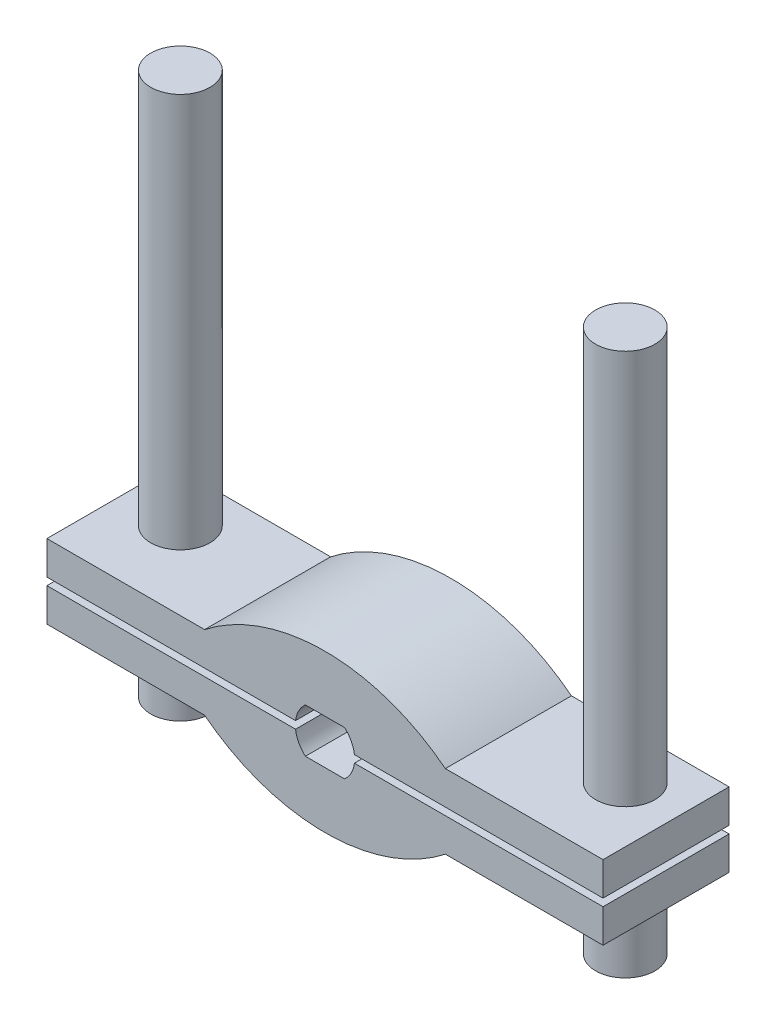
ISO-10303-21;
HEADER;
FILE_DESCRIPTION(('STEP AP214'),'2;1');
FILE_NAME('part.step','',(''),(''),'','','');
FILE_SCHEMA(('AUTOMOTIVE_DESIGN { 1 0 10303 214 1 1 1 1 }'));
ENDSEC;
DATA;
#1=APPLICATION_CONTEXT('core data for automotive mechanical design processes');
#2=APPLICATION_PROTOCOL_DEFINITION('international standard','automotive_design',2000,#1);
#3=PRODUCT_CONTEXT('',#1,'mechanical');
#4=PRODUCT('Part','Part','',(#3));
#5=PRODUCT_RELATED_PRODUCT_CATEGORY('part','',(#4));
#6=PRODUCT_DEFINITION_FORMATION('','',#4);
#7=PRODUCT_DEFINITION_CONTEXT('part definition',#1,'design');
#8=PRODUCT_DEFINITION('design','',#6,#7);
#9=PRODUCT_DEFINITION_SHAPE('','',#8);
#10=(LENGTH_UNIT() NAMED_UNIT(*) SI_UNIT(.MILLI.,.METRE.));
#11=(NAMED_UNIT(*) PLANE_ANGLE_UNIT() SI_UNIT($,.RADIAN.));
#12=(NAMED_UNIT(*) SI_UNIT($,.STERADIAN.) SOLID_ANGLE_UNIT());
#13=UNCERTAINTY_MEASURE_WITH_UNIT(LENGTH_MEASURE(1.E-05),#10,'distance_accuracy_value','');
#14=(GEOMETRIC_REPRESENTATION_CONTEXT(3) GLOBAL_UNCERTAINTY_ASSIGNED_CONTEXT((#13)) GLOBAL_UNIT_ASSIGNED_CONTEXT((#10,
#11,#12)) REPRESENTATION_CONTEXT('',''));
#15=CARTESIAN_POINT('',(0.,0.,0.));
#16=DIRECTION('',(0.,0.,1.));
#17=DIRECTION('',(1.,0.,0.));
#18=AXIS2_PLACEMENT_3D('',#15,#16,#17);
#19=CARTESIAN_POINT('',(0.,31.4655203588068,-111.672646407854));
#20=DIRECTION('',(0.,0.,1.));
#21=DIRECTION('',(1.,0.,0.));
#22=AXIS2_PLACEMENT_3D('',#19,#20,#21);
#23=CYLINDRICAL_SURFACE('',#22,52.6655203587927);
#24=CARTESIAN_POINT('',(0.,31.4655203588068,-33.9999999999999));
#25=DIRECTION('',(0.,0.,1.));
#26=DIRECTION('',(1.,0.,0.));
#27=AXIS2_PLACEMENT_3D('',#24,#25,#26);
#28=CIRCLE('',#27,52.6655203587927);
#29=CARTESIAN_POINT('',(32.4694880778216,-9.99999999999976,-33.9999999999999));
#30=VERTEX_POINT('',#29);
#31=CARTESIAN_POINT('',(-32.4694880778215,-9.99999999999999,-33.9999999999999));
#32=VERTEX_POINT('',#31);
#33=EDGE_CURVE('E57',#30,#32,#28,.F.);
#34=ORIENTED_EDGE('',*,*,#33,.F.);
#35=DIRECTION('',(0.,0.,1.));
#36=VECTOR('',#35,1.);
#37=CARTESIAN_POINT('',(32.4694880778216,-9.99999999999976,-111.672646407854));
#38=LINE('',#37,#36);
#39=CARTESIAN_POINT('',(32.4694880778216,-9.99999999999976,0.));
#40=VERTEX_POINT('',#39);
#41=EDGE_CURVE('E212',#30,#40,#38,.T.);
#42=ORIENTED_EDGE('',*,*,#41,.T.);
#43=CARTESIAN_POINT('',(0.,31.4655203588068,0.));
#44=DIRECTION('',(0.,0.,1.));
#45=DIRECTION('',(-1.,0.,0.));
#46=AXIS2_PLACEMENT_3D('',#43,#44,#45);
#47=CIRCLE('',#46,52.6655203587927);
#48=CARTESIAN_POINT('',(-32.4694880778215,-9.99999999999999,0.));
#49=VERTEX_POINT('',#48);
#50=EDGE_CURVE('E183',#49,#40,#47,.T.);
#51=ORIENTED_EDGE('',*,*,#50,.F.);
#52=DIRECTION('',(0.,0.,1.));
#53=VECTOR('',#52,1.);
#54=CARTESIAN_POINT('',(-32.4694880778215,-9.99999999999999,-111.672646407854));
#55=LINE('',#54,#53);
#56=EDGE_CURVE('E167',#32,#49,#55,.T.);
#57=ORIENTED_EDGE('',*,*,#56,.F.);
#58=EDGE_LOOP('',(#34,#42,#51,#57));
#59=FACE_BOUND('',#58,.T.);
#60=ADVANCED_FACE('F49',(#59),#23,.T.);
#61=CARTESIAN_POINT('',(-32.4694880778215,-9.99999999999999,-111.672646407854));
#62=DIRECTION('',(0.,-1.,0.));
#63=DIRECTION('',(1.,0.,0.));
#64=AXIS2_PLACEMENT_3D('',#61,#62,#63);
#65=PLANE('',#64);
#66=CARTESIAN_POINT('',(-60.,-9.99999999999999,-21.));
#67=DIRECTION('',(0.,-1.,0.));
#68=DIRECTION('',(1.,0.,0.));
#69=AXIS2_PLACEMENT_3D('',#66,#67,#68);
#70=CIRCLE('',#69,8.25);
#71=CARTESIAN_POINT('',(-51.75,-9.99999999999999,-21.));
#72=VERTEX_POINT('',#71);
#73=EDGE_CURVE('E159',#72,#72,#70,.T.);
#74=ORIENTED_EDGE('',*,*,#73,.F.);
#75=EDGE_LOOP('',(#74));
#76=FACE_BOUND('',#75,.T.);
#77=DIRECTION('',(-1.,0.,0.));
#78=VECTOR('',#77,1.);
#79=CARTESIAN_POINT('',(-32.4694880778215,-9.99999999999999,-33.9999999999999));
#80=LINE('',#79,#78);
#81=CARTESIAN_POINT('',(-75.,-9.99999999999999,-33.9999999999999));
#82=VERTEX_POINT('',#81);
#83=EDGE_CURVE('E170',#32,#82,#80,.T.);
#84=ORIENTED_EDGE('',*,*,#83,.F.);
#85=ORIENTED_EDGE('',*,*,#56,.T.);
#86=DIRECTION('',(1.,0.,0.));
#87=VECTOR('',#86,1.);
#88=CARTESIAN_POINT('',(-32.4694880778215,-9.99999999999999,0.));
#89=LINE('',#88,#87);
#90=CARTESIAN_POINT('',(-75.,-9.99999999999999,0.));
#91=VERTEX_POINT('',#90);
#92=EDGE_CURVE('E180',#91,#49,#89,.T.);
#93=ORIENTED_EDGE('',*,*,#92,.F.);
#94=DIRECTION('',(0.,0.,1.));
#95=VECTOR('',#94,1.);
#96=CARTESIAN_POINT('',(-75.,-9.99999999999999,-111.672646407854));
#97=LINE('',#96,#95);
#98=EDGE_CURVE('E186',#82,#91,#97,.T.);
#99=ORIENTED_EDGE('',*,*,#98,.F.);
#100=EDGE_LOOP('',(#84,#85,#93,#99));
#101=FACE_BOUND('',#100,.T.);
#102=ADVANCED_FACE('F206',(#76,#101),#65,.T.);
#103=CARTESIAN_POINT('',(-75.,-0.99999999999999,-111.672646407854));
#104=DIRECTION('',(-1.,0.,0.));
#105=DIRECTION('',(0.,0.,1.));
#106=AXIS2_PLACEMENT_3D('',#103,#104,#105);
#107=PLANE('',#106);
#108=DIRECTION('',(0.,1.,0.));
#109=VECTOR('',#108,1.);
#110=CARTESIAN_POINT('',(-75.,-0.99999999999999,-33.9999999999999));
#111=LINE('',#110,#109);
#112=CARTESIAN_POINT('',(-75.,-0.99999999999999,-33.9999999999999));
#113=VERTEX_POINT('',#112);
#114=EDGE_CURVE('E69',#82,#113,#111,.T.);
#115=ORIENTED_EDGE('',*,*,#114,.F.);
#116=ORIENTED_EDGE('',*,*,#98,.T.);
#117=DIRECTION('',(0.,-1.,0.));
#118=VECTOR('',#117,1.);
#119=CARTESIAN_POINT('',(-75.,-0.99999999999999,0.));
#120=LINE('',#119,#118);
#121=CARTESIAN_POINT('',(-75.,-0.99999999999999,0.));
#122=VERTEX_POINT('',#121);
#123=EDGE_CURVE('E177',#122,#91,#120,.T.);
#124=ORIENTED_EDGE('',*,*,#123,.F.);
#125=DIRECTION('',(0.,0.,1.));
#126=VECTOR('',#125,1.);
#127=CARTESIAN_POINT('',(-75.,-0.99999999999999,-111.672646407854));
#128=LINE('',#127,#126);
#129=EDGE_CURVE('E188',#113,#122,#128,.T.);
#130=ORIENTED_EDGE('',*,*,#129,.F.);
#131=EDGE_LOOP('',(#115,#116,#124,#130));
#132=FACE_BOUND('',#131,.T.);
#133=ADVANCED_FACE('F202',(#132),#107,.T.);
#134=CARTESIAN_POINT('',(-7.9372539331829,-0.999999999999999,-111.672646407854));
#135=DIRECTION('',(0.,1.,0.));
#136=DIRECTION('',(-1.,0.,0.));
#137=AXIS2_PLACEMENT_3D('',#134,#135,#136);
#138=PLANE('',#137);
#139=CARTESIAN_POINT('',(-60.,-0.99999999999999,-21.));
#140=DIRECTION('',(0.,1.,0.));
#141=DIRECTION('',(-1.,0.,0.));
#142=AXIS2_PLACEMENT_3D('',#139,#140,#141);
#143=CIRCLE('',#142,8.25);
#144=CARTESIAN_POINT('',(-68.25,-0.999999999999989,-21.));
#145=VERTEX_POINT('',#144);
#146=EDGE_CURVE('E135',#145,#145,#143,.F.);
#147=ORIENTED_EDGE('',*,*,#146,.T.);
#148=EDGE_LOOP('',(#147));
#149=FACE_BOUND('',#148,.T.);
#150=DIRECTION('',(1.,0.,0.));
#151=VECTOR('',#150,1.);
#152=CARTESIAN_POINT('',(-7.9372539331829,-0.999999999999999,-33.9999999999999));
#153=LINE('',#152,#151);
#154=CARTESIAN_POINT('',(-7.9372539331829,-0.999999999999999,-33.9999999999999));
#155=VERTEX_POINT('',#154);
#156=EDGE_CURVE('E64',#113,#155,#153,.T.);
#157=ORIENTED_EDGE('',*,*,#156,.F.);
#158=ORIENTED_EDGE('',*,*,#129,.T.);
#159=DIRECTION('',(-1.,0.,0.));
#160=VECTOR('',#159,1.);
#161=CARTESIAN_POINT('',(-7.9372539331829,-0.999999999999999,0.));
#162=LINE('',#161,#160);
#163=CARTESIAN_POINT('',(-7.9372539331829,-0.999999999999999,0.));
#164=VERTEX_POINT('',#163);
#165=EDGE_CURVE('E174',#164,#122,#162,.T.);
#166=ORIENTED_EDGE('',*,*,#165,.F.);
#167=DIRECTION('',(0.,0.,1.));
#168=VECTOR('',#167,1.);
#169=CARTESIAN_POINT('',(-7.9372539331829,-0.999999999999999,-111.672646407854));
#170=LINE('',#169,#168);
#171=EDGE_CURVE('E190',#155,#164,#170,.T.);
#172=ORIENTED_EDGE('',*,*,#171,.F.);
#173=EDGE_LOOP('',(#157,#158,#166,#172));
#174=FACE_BOUND('',#173,.T.);
#175=ADVANCED_FACE('F196',(#149,#174),#138,.T.);
#176=CARTESIAN_POINT('',(0.,0.,-111.672646407854));
#177=DIRECTION('',(0.,0.,1.));
#178=DIRECTION('',(1.,0.,0.));
#179=AXIS2_PLACEMENT_3D('',#176,#177,#178);
#180=CYLINDRICAL_SURFACE('',#179,7.99999999998921);
#181=CARTESIAN_POINT('',(0.,0.,-33.9999999999999));
#182=DIRECTION('',(0.,0.,1.));
#183=DIRECTION('',(1.,0.,0.));
#184=AXIS2_PLACEMENT_3D('',#181,#182,#183);
#185=CIRCLE('',#184,7.99999999998921);
#186=CARTESIAN_POINT('',(-5.29150262213566,-5.9999999999799,-33.9999999999999));
#187=VERTEX_POINT('',#186);
#188=EDGE_CURVE('E165',#155,#187,#185,.T.);
#189=ORIENTED_EDGE('',*,*,#188,.F.);
#190=ORIENTED_EDGE('',*,*,#171,.T.);
#191=CARTESIAN_POINT('',(0.,0.,0.));
#192=DIRECTION('',(0.,0.,-1.));
#193=DIRECTION('',(-1.,0.,0.));
#194=AXIS2_PLACEMENT_3D('',#191,#192,#193);
#195=CIRCLE('',#194,7.99999999998921);
#196=CARTESIAN_POINT('',(-5.29150262213566,-5.9999999999799,0.));
#197=VERTEX_POINT('',#196);
#198=EDGE_CURVE('E134',#197,#164,#195,.T.);
#199=ORIENTED_EDGE('',*,*,#198,.F.);
#200=DIRECTION('',(0.,0.,1.));
#201=VECTOR('',#200,1.);
#202=CARTESIAN_POINT('',(-5.29150262213566,-5.9999999999799,-111.672646407854));
#203=LINE('',#202,#201);
#204=EDGE_CURVE('E130',#187,#197,#203,.T.);
#205=ORIENTED_EDGE('',*,*,#204,.F.);
#206=EDGE_LOOP('',(#189,#190,#199,#205));
#207=FACE_BOUND('',#206,.T.);
#208=ADVANCED_FACE('F194',(#207),#180,.F.);
#209=CARTESIAN_POINT('',(0.,-5.99999999997181,-111.672646407854));
#210=DIRECTION('',(-1.52917200113342E-12,1.,0.));
#211=DIRECTION('',(-1.,-1.52917200113342E-12,0.));
#212=AXIS2_PLACEMENT_3D('',#209,#210,#211);
#213=PLANE('',#212);
#214=DIRECTION('',(1.,1.52917200113342E-12,0.));
#215=VECTOR('',#214,1.);
#216=CARTESIAN_POINT('',(0.,-5.99999999997181,-33.9999999999999));
#217=LINE('',#216,#215);
#218=CARTESIAN_POINT('',(5.2915026221357,-5.99999999997986,-33.9999999999999));
#219=VERTEX_POINT('',#218);
#220=EDGE_CURVE('E12',#187,#219,#217,.T.);
#221=ORIENTED_EDGE('',*,*,#220,.F.);
#222=ORIENTED_EDGE('',*,*,#204,.T.);
#223=DIRECTION('',(-1.,-1.52917200113342E-12,0.));
#224=VECTOR('',#223,1.);
#225=CARTESIAN_POINT('',(0.,-5.99999999997181,0.));
#226=LINE('',#225,#224);
#227=CARTESIAN_POINT('',(5.2915026221357,-5.99999999997986,0.));
#228=VERTEX_POINT('',#227);
#229=EDGE_CURVE('E123',#228,#197,#226,.T.);
#230=ORIENTED_EDGE('',*,*,#229,.F.);
#231=DIRECTION('',(0.,0.,1.));
#232=VECTOR('',#231,1.);
#233=CARTESIAN_POINT('',(5.2915026221357,-5.99999999997986,-111.672646407854));
#234=LINE('',#233,#232);
#235=EDGE_CURVE('E127',#219,#228,#234,.T.);
#236=ORIENTED_EDGE('',*,*,#235,.F.);
#237=EDGE_LOOP('',(#221,#222,#230,#236));
#238=FACE_BOUND('',#237,.T.);
#239=ADVANCED_FACE('F51',(#238),#213,.T.);
#240=CARTESIAN_POINT('',(0.,0.,0.));
#241=DIRECTION('',(0.,0.,-1.));
#242=DIRECTION('',(-1.,0.,0.));
#243=AXIS2_PLACEMENT_3D('',#240,#241,#242);
#244=PLANE('',#243);
#245=ORIENTED_EDGE('',*,*,#50,.T.);
#246=DIRECTION('',(-1.,0.,0.));
#247=VECTOR('',#246,1.);
#248=CARTESIAN_POINT('',(32.4694880778216,-9.99999999999976,0.));
#249=LINE('',#248,#247);
#250=CARTESIAN_POINT('',(75.0000000000001,-9.99999999999944,0.));
#251=VERTEX_POINT('',#250);
#252=EDGE_CURVE('E150',#251,#40,#249,.T.);
#253=ORIENTED_EDGE('',*,*,#252,.F.);
#254=DIRECTION('',(0.,-1.,0.));
#255=VECTOR('',#254,1.);
#256=CARTESIAN_POINT('',(75.,-0.999999999999444,0.));
#257=LINE('',#256,#255);
#258=CARTESIAN_POINT('',(75.,-0.999999999999444,0.));
#259=VERTEX_POINT('',#258);
#260=EDGE_CURVE('E155',#259,#251,#257,.T.);
#261=ORIENTED_EDGE('',*,*,#260,.F.);
#262=DIRECTION('',(1.,0.,0.));
#263=VECTOR('',#262,1.);
#264=CARTESIAN_POINT('',(7.9372539331829,-0.999999999999942,0.));
#265=LINE('',#264,#263);
#266=CARTESIAN_POINT('',(7.9372539331829,-0.999999999999942,0.));
#267=VERTEX_POINT('',#266);
#268=EDGE_CURVE('E141',#267,#259,#265,.T.);
#269=ORIENTED_EDGE('',*,*,#268,.F.);
#270=CARTESIAN_POINT('',(0.,0.,0.));
#271=DIRECTION('',(0.,0.,1.));
#272=DIRECTION('',(1.,0.,0.));
#273=AXIS2_PLACEMENT_3D('',#270,#271,#272);
#274=CIRCLE('',#273,7.99999999998921);
#275=EDGE_CURVE('E138',#228,#267,#274,.T.);
#276=ORIENTED_EDGE('',*,*,#275,.F.);
#277=ORIENTED_EDGE('',*,*,#229,.T.);
#278=ORIENTED_EDGE('',*,*,#198,.T.);
#279=ORIENTED_EDGE('',*,*,#165,.T.);
#280=ORIENTED_EDGE('',*,*,#123,.T.);
#281=ORIENTED_EDGE('',*,*,#92,.T.);
#282=EDGE_LOOP('',(#245,#253,#261,#269,#276,#277,#278,#279,#280,#281));
#283=FACE_BOUND('',#282,.T.);
#284=ADVANCED_FACE('F139',(#283),#244,.F.);
#285=CARTESIAN_POINT('',(-7.99999999999956,0.,-33.9999999999999));
#286=DIRECTION('',(0.,0.,1.));
#287=DIRECTION('',(0.,1.,0.));
#288=AXIS2_PLACEMENT_3D('',#285,#286,#287);
#289=PLANE('',#288);
#290=ORIENTED_EDGE('',*,*,#220,.T.);
#291=CARTESIAN_POINT('',(0.,0.,-33.9999999999999));
#292=DIRECTION('',(0.,0.,-1.));
#293=DIRECTION('',(-1.,0.,0.));
#294=AXIS2_PLACEMENT_3D('',#291,#292,#293);
#295=CIRCLE('',#294,7.99999999998921);
#296=CARTESIAN_POINT('',(7.9372539331829,-0.999999999999942,-33.9999999999999));
#297=VERTEX_POINT('',#296);
#298=EDGE_CURVE('E148',#297,#219,#295,.T.);
#299=ORIENTED_EDGE('',*,*,#298,.F.);
#300=DIRECTION('',(-1.,0.,0.));
#301=VECTOR('',#300,1.);
#302=CARTESIAN_POINT('',(7.9372539331829,-0.999999999999942,-33.9999999999999));
#303=LINE('',#302,#301);
#304=CARTESIAN_POINT('',(75.,-0.999999999999444,-33.9999999999999));
#305=VERTEX_POINT('',#304);
#306=EDGE_CURVE('E231',#305,#297,#303,.T.);
#307=ORIENTED_EDGE('',*,*,#306,.F.);
#308=DIRECTION('',(0.,1.,0.));
#309=VECTOR('',#308,1.);
#310=CARTESIAN_POINT('',(75.,-0.999999999999444,-33.9999999999999));
#311=LINE('',#310,#309);
#312=CARTESIAN_POINT('',(75.0000000000001,-9.99999999999944,-33.9999999999999));
#313=VERTEX_POINT('',#312);
#314=EDGE_CURVE('E229',#313,#305,#311,.T.);
#315=ORIENTED_EDGE('',*,*,#314,.F.);
#316=DIRECTION('',(1.,0.,0.));
#317=VECTOR('',#316,1.);
#318=CARTESIAN_POINT('',(32.4694880778216,-9.99999999999976,-33.9999999999999));
#319=LINE('',#318,#317);
#320=EDGE_CURVE('E162',#30,#313,#319,.T.);
#321=ORIENTED_EDGE('',*,*,#320,.F.);
#322=ORIENTED_EDGE('',*,*,#33,.T.);
#323=ORIENTED_EDGE('',*,*,#83,.T.);
#324=ORIENTED_EDGE('',*,*,#114,.T.);
#325=ORIENTED_EDGE('',*,*,#156,.T.);
#326=ORIENTED_EDGE('',*,*,#188,.T.);
#327=EDGE_LOOP('',(#290,#299,#307,#315,#321,#322,#323,#324,#325,#326));
#328=FACE_BOUND('',#327,.T.);
#329=ADVANCED_FACE('F254',(#328),#289,.F.);
#330=CARTESIAN_POINT('',(-60.,22.3345237791561,-21.));
#331=DIRECTION('',(0.,-1.,0.));
#332=DIRECTION('',(1.,0.,0.));
#333=AXIS2_PLACEMENT_3D('',#330,#331,#332);
#334=CYLINDRICAL_SURFACE('',#333,8.25);
#335=ORIENTED_EDGE('',*,*,#73,.T.);
#336=EDGE_LOOP('',(#335));
#337=FACE_BOUND('',#336,.T.);
#338=ORIENTED_EDGE('',*,*,#146,.F.);
#339=EDGE_LOOP('',(#338));
#340=FACE_BOUND('',#339,.T.);
#341=ADVANCED_FACE('F260',(#337,#340),#334,.F.);
#342=CARTESIAN_POINT('',(32.4694880778216,-9.99999999999976,-111.672646407854));
#343=DIRECTION('',(0.,-1.,0.));
#344=DIRECTION('',(-1.,0.,0.));
#345=AXIS2_PLACEMENT_3D('',#342,#343,#344);
#346=PLANE('',#345);
#347=CARTESIAN_POINT('',(60.0000000000001,-9.99999999999955,-21.));
#348=DIRECTION('',(0.,1.,0.));
#349=DIRECTION('',(-1.,0.,0.));
#350=AXIS2_PLACEMENT_3D('',#347,#348,#349);
#351=CIRCLE('',#350,8.25);
#352=CARTESIAN_POINT('',(51.75,-9.99999999999961,-21.));
#353=VERTEX_POINT('',#352);
#354=EDGE_CURVE('E237',#353,#353,#351,.T.);
#355=ORIENTED_EDGE('',*,*,#354,.T.);
#356=EDGE_LOOP('',(#355));
#357=FACE_BOUND('',#356,.T.);
#358=ORIENTED_EDGE('',*,*,#320,.T.);
#359=DIRECTION('',(0.,0.,1.));
#360=VECTOR('',#359,1.);
#361=CARTESIAN_POINT('',(75.0000000000001,-9.99999999999944,-111.672646407854));
#362=LINE('',#361,#360);
#363=EDGE_CURVE('E219',#313,#251,#362,.T.);
#364=ORIENTED_EDGE('',*,*,#363,.T.);
#365=ORIENTED_EDGE('',*,*,#252,.T.);
#366=ORIENTED_EDGE('',*,*,#41,.F.);
#367=EDGE_LOOP('',(#358,#364,#365,#366));
#368=FACE_BOUND('',#367,.T.);
#369=ADVANCED_FACE('F217',(#357,#368),#346,.T.);
#370=CARTESIAN_POINT('',(75.,-0.999999999999444,-111.672646407854));
#371=DIRECTION('',(1.,0.,0.));
#372=DIRECTION('',(0.,0.,1.));
#373=AXIS2_PLACEMENT_3D('',#370,#371,#372);
#374=PLANE('',#373);
#375=ORIENTED_EDGE('',*,*,#314,.T.);
#376=DIRECTION('',(0.,0.,1.));
#377=VECTOR('',#376,1.);
#378=CARTESIAN_POINT('',(75.,-0.999999999999444,-111.672646407854));
#379=LINE('',#378,#377);
#380=EDGE_CURVE('E152',#305,#259,#379,.T.);
#381=ORIENTED_EDGE('',*,*,#380,.T.);
#382=ORIENTED_EDGE('',*,*,#260,.T.);
#383=ORIENTED_EDGE('',*,*,#363,.F.);
#384=EDGE_LOOP('',(#375,#381,#382,#383));
#385=FACE_BOUND('',#384,.T.);
#386=ADVANCED_FACE('F251',(#385),#374,.T.);
#387=CARTESIAN_POINT('',(7.9372539331829,-0.999999999999942,-111.672646407854));
#388=DIRECTION('',(0.,1.,0.));
#389=DIRECTION('',(1.,0.,0.));
#390=AXIS2_PLACEMENT_3D('',#387,#388,#389);
#391=PLANE('',#390);
#392=CARTESIAN_POINT('',(60.,-0.999999999999552,-21.));
#393=DIRECTION('',(0.,-1.,0.));
#394=DIRECTION('',(1.,0.,0.));
#395=AXIS2_PLACEMENT_3D('',#392,#393,#394);
#396=CIRCLE('',#395,8.25);
#397=CARTESIAN_POINT('',(68.25,-0.99999999999949,-21.));
#398=VERTEX_POINT('',#397);
#399=EDGE_CURVE('E145',#398,#398,#396,.F.);
#400=ORIENTED_EDGE('',*,*,#399,.F.);
#401=EDGE_LOOP('',(#400));
#402=FACE_BOUND('',#401,.T.);
#403=ORIENTED_EDGE('',*,*,#306,.T.);
#404=DIRECTION('',(0.,0.,1.));
#405=VECTOR('',#404,1.);
#406=CARTESIAN_POINT('',(7.9372539331829,-0.999999999999942,-111.672646407854));
#407=LINE('',#406,#405);
#408=EDGE_CURVE('E149',#297,#267,#407,.T.);
#409=ORIENTED_EDGE('',*,*,#408,.T.);
#410=ORIENTED_EDGE('',*,*,#268,.T.);
#411=ORIENTED_EDGE('',*,*,#380,.F.);
#412=EDGE_LOOP('',(#403,#409,#410,#411));
#413=FACE_BOUND('',#412,.T.);
#414=ADVANCED_FACE('F248',(#402,#413),#391,.T.);
#415=CARTESIAN_POINT('',(0.,0.,-111.672646407854));
#416=DIRECTION('',(0.,0.,1.));
#417=DIRECTION('',(-1.,0.,0.));
#418=AXIS2_PLACEMENT_3D('',#415,#416,#417);
#419=CYLINDRICAL_SURFACE('',#418,7.99999999998921);
#420=ORIENTED_EDGE('',*,*,#298,.T.);
#421=ORIENTED_EDGE('',*,*,#235,.T.);
#422=ORIENTED_EDGE('',*,*,#275,.T.);
#423=ORIENTED_EDGE('',*,*,#408,.F.);
#424=EDGE_LOOP('',(#420,#421,#422,#423));
#425=FACE_BOUND('',#424,.T.);
#426=ADVANCED_FACE('F147',(#425),#419,.F.);
#427=CARTESIAN_POINT('',(59.9999999999998,22.3345237791565,-21.));
#428=DIRECTION('',(0.,-1.,0.));
#429=DIRECTION('',(-1.,0.,0.));
#430=AXIS2_PLACEMENT_3D('',#427,#428,#429);
#431=CYLINDRICAL_SURFACE('',#430,8.25);
#432=ORIENTED_EDGE('',*,*,#354,.F.);
#433=EDGE_LOOP('',(#432));
#434=FACE_BOUND('',#433,.T.);
#435=ORIENTED_EDGE('',*,*,#399,.T.);
#436=EDGE_LOOP('',(#435));
#437=FACE_BOUND('',#436,.T.);
#438=ADVANCED_FACE('F242',(#434,#437),#431,.F.);
#439=CLOSED_SHELL('',(#60,#102,#133,#175,#208,#239,#284,#329,#341,#369,#386,#414,#426,#438));
#440=MANIFOLD_SOLID_BREP('B2',#439);
#441=CARTESIAN_POINT('',(-75.,0.999999999999994,-111.672646407854));
#442=DIRECTION('',(-1.,0.,0.));
#443=DIRECTION('',(0.,0.,1.));
#444=AXIS2_PLACEMENT_3D('',#441,#442,#443);
#445=PLANE('',#444);
#446=DIRECTION('',(0.,1.,0.));
#447=VECTOR('',#446,1.);
#448=CARTESIAN_POINT('',(-75.,0.999999999999994,-33.9999999999999));
#449=LINE('',#448,#447);
#450=CARTESIAN_POINT('',(-75.,0.999999999999994,-33.9999999999999));
#451=VERTEX_POINT('',#450);
#452=CARTESIAN_POINT('',(-75.,9.99999999999999,-33.9999999999999));
#453=VERTEX_POINT('',#452);
#454=EDGE_CURVE('E523',#451,#453,#449,.T.);
#455=ORIENTED_EDGE('',*,*,#454,.F.);
#456=DIRECTION('',(0.,0.,1.));
#457=VECTOR('',#456,1.);
#458=CARTESIAN_POINT('',(-75.,0.999999999999994,-111.672646407854));
#459=LINE('',#458,#457);
#460=CARTESIAN_POINT('',(-75.,0.999999999999994,0.));
#461=VERTEX_POINT('',#460);
#462=EDGE_CURVE('E541',#451,#461,#459,.T.);
#463=ORIENTED_EDGE('',*,*,#462,.T.);
#464=DIRECTION('',(0.,-1.,0.));
#465=VECTOR('',#464,1.);
#466=CARTESIAN_POINT('',(-75.,0.999999999999994,0.));
#467=LINE('',#466,#465);
#468=CARTESIAN_POINT('',(-75.,9.99999999999999,0.));
#469=VERTEX_POINT('',#468);
#470=EDGE_CURVE('E514',#469,#461,#467,.T.);
#471=ORIENTED_EDGE('',*,*,#470,.F.);
#472=DIRECTION('',(0.,0.,1.));
#473=VECTOR('',#472,1.);
#474=CARTESIAN_POINT('',(-75.,9.99999999999999,-111.672646407854));
#475=LINE('',#474,#473);
#476=EDGE_CURVE('E517',#453,#469,#475,.T.);
#477=ORIENTED_EDGE('',*,*,#476,.F.);
#478=EDGE_LOOP('',(#455,#463,#471,#477));
#479=FACE_BOUND('',#478,.T.);
#480=ADVANCED_FACE('F383',(#479),#445,.T.);
#481=CARTESIAN_POINT('',(-32.4694880778215,9.99999999999999,-111.672646407854));
#482=DIRECTION('',(0.,1.,0.));
#483=DIRECTION('',(-1.,0.,0.));
#484=AXIS2_PLACEMENT_3D('',#481,#482,#483);
#485=PLANE('',#484);
#486=CARTESIAN_POINT('',(-60.,9.99999999999999,-21.));
#487=DIRECTION('',(0.,1.,0.));
#488=DIRECTION('',(-1.,0.,0.));
#489=AXIS2_PLACEMENT_3D('',#486,#487,#488);
#490=CIRCLE('',#489,8.);
#491=CARTESIAN_POINT('',(-68.,9.99999999999999,-21.));
#492=VERTEX_POINT('',#491);
#493=EDGE_CURVE('E508',#492,#492,#490,.T.);
#494=ORIENTED_EDGE('',*,*,#493,.F.);
#495=EDGE_LOOP('',(#494));
#496=FACE_BOUND('',#495,.T.);
#497=DIRECTION('',(1.,0.,0.));
#498=VECTOR('',#497,1.);
#499=CARTESIAN_POINT('',(-32.4694880778215,9.99999999999999,-33.9999999999999));
#500=LINE('',#499,#498);
#501=CARTESIAN_POINT('',(-32.4694880778215,10.,-33.9999999999999));
#502=VERTEX_POINT('',#501);
#503=EDGE_CURVE('E521',#453,#502,#500,.T.);
#504=ORIENTED_EDGE('',*,*,#503,.F.);
#505=ORIENTED_EDGE('',*,*,#476,.T.);
#506=DIRECTION('',(-1.,0.,0.));
#507=VECTOR('',#506,1.);
#508=CARTESIAN_POINT('',(-32.4694880778215,9.99999999999999,0.));
#509=LINE('',#508,#507);
#510=CARTESIAN_POINT('',(-32.4694880778215,9.99999999999999,0.));
#511=VERTEX_POINT('',#510);
#512=EDGE_CURVE('E538',#511,#469,#509,.T.);
#513=ORIENTED_EDGE('',*,*,#512,.F.);
#514=DIRECTION('',(0.,0.,1.));
#515=VECTOR('',#514,1.);
#516=CARTESIAN_POINT('',(-32.4694880778215,9.99999999999999,-111.672646407854));
#517=LINE('',#516,#515);
#518=EDGE_CURVE('E543',#502,#511,#517,.T.);
#519=ORIENTED_EDGE('',*,*,#518,.F.);
#520=EDGE_LOOP('',(#504,#505,#513,#519));
#521=FACE_BOUND('',#520,.T.);
#522=ADVANCED_FACE('F565',(#496,#521),#485,.T.);
#523=CARTESIAN_POINT('',(0.,-31.4655203588068,-111.672646407854));
#524=DIRECTION('',(0.,0.,1.));
#525=DIRECTION('',(1.,0.,0.));
#526=AXIS2_PLACEMENT_3D('',#523,#524,#525);
#527=CYLINDRICAL_SURFACE('',#526,52.6655203587927);
#528=CARTESIAN_POINT('',(0.,-31.4655203588068,-33.9999999999999));
#529=DIRECTION('',(0.,0.,1.));
#530=DIRECTION('',(1.,0.,0.));
#531=AXIS2_PLACEMENT_3D('',#528,#529,#530);
#532=CIRCLE('',#531,52.6655203587927);
#533=CARTESIAN_POINT('',(32.4694880778214,10.0000000000002,-33.9999999999999));
#534=VERTEX_POINT('',#533);
#535=EDGE_CURVE('E519',#502,#534,#532,.F.);
#536=ORIENTED_EDGE('',*,*,#535,.F.);
#537=ORIENTED_EDGE('',*,*,#518,.T.);
#538=CARTESIAN_POINT('',(0.,-31.4655203588068,0.));
#539=DIRECTION('',(0.,0.,1.));
#540=DIRECTION('',(1.,0.,0.));
#541=AXIS2_PLACEMENT_3D('',#538,#539,#540);
#542=CIRCLE('',#541,52.6655203587927);
#543=CARTESIAN_POINT('',(32.4694880778214,10.0000000000002,0.));
#544=VERTEX_POINT('',#543);
#545=EDGE_CURVE('E535',#544,#511,#542,.T.);
#546=ORIENTED_EDGE('',*,*,#545,.F.);
#547=DIRECTION('',(0.,0.,1.));
#548=VECTOR('',#547,1.);
#549=CARTESIAN_POINT('',(32.4694880778214,10.0000000000002,-111.672646407854));
#550=LINE('',#549,#548);
#551=EDGE_CURVE('E494',#534,#544,#550,.T.);
#552=ORIENTED_EDGE('',*,*,#551,.F.);
#553=EDGE_LOOP('',(#536,#537,#546,#552));
#554=FACE_BOUND('',#553,.T.);
#555=ADVANCED_FACE('F569',(#554),#527,.T.);
#556=CARTESIAN_POINT('',(0.,5.99999999997181,-111.672646407854));
#557=DIRECTION('',(0.,-1.,0.));
#558=DIRECTION('',(1.,0.,0.));
#559=AXIS2_PLACEMENT_3D('',#556,#557,#558);
#560=PLANE('',#559);
#561=DIRECTION('',(-1.,0.,0.));
#562=VECTOR('',#561,1.);
#563=CARTESIAN_POINT('',(0.,5.99999999997181,-33.9999999999999));
#564=LINE('',#563,#562);
#565=CARTESIAN_POINT('',(5.29150262213204,5.99999999997589,-33.9999999999999));
#566=VERTEX_POINT('',#565);
#567=CARTESIAN_POINT('',(-5.29150262213209,5.99999999997585,-33.9999999999999));
#568=VERTEX_POINT('',#567);
#569=EDGE_CURVE('E398',#566,#568,#564,.T.);
#570=ORIENTED_EDGE('',*,*,#569,.F.);
#571=DIRECTION('',(0.,0.,1.));
#572=VECTOR('',#571,1.);
#573=CARTESIAN_POINT('',(5.29150262212847,5.99999999997185,-111.672646407854));
#574=LINE('',#573,#572);
#575=CARTESIAN_POINT('',(5.29150262212847,5.99999999997185,0.));
#576=VERTEX_POINT('',#575);
#577=EDGE_CURVE('E497',#566,#576,#574,.T.);
#578=ORIENTED_EDGE('',*,*,#577,.T.);
#579=DIRECTION('',(1.,0.,0.));
#580=VECTOR('',#579,1.);
#581=CARTESIAN_POINT('',(0.,5.99999999997181,0.));
#582=LINE('',#581,#580);
#583=CARTESIAN_POINT('',(-5.29150262212852,5.99999999997181,0.));
#584=VERTEX_POINT('',#583);
#585=EDGE_CURVE('E533',#584,#576,#582,.T.);
#586=ORIENTED_EDGE('',*,*,#585,.F.);
#587=DIRECTION('',(0.,0.,1.));
#588=VECTOR('',#587,1.);
#589=CARTESIAN_POINT('',(-5.29150262212852,5.99999999997181,-111.672646407854));
#590=LINE('',#589,#588);
#591=EDGE_CURVE('E545',#568,#584,#590,.T.);
#592=ORIENTED_EDGE('',*,*,#591,.F.);
#593=EDGE_LOOP('',(#570,#578,#586,#592));
#594=FACE_BOUND('',#593,.T.);
#595=ADVANCED_FACE('F608',(#594),#560,.T.);
#596=CARTESIAN_POINT('',(0.,0.,-111.672646407854));
#597=DIRECTION('',(0.,0.,1.));
#598=DIRECTION('',(1.,0.,0.));
#599=AXIS2_PLACEMENT_3D('',#596,#597,#598);
#600=CYLINDRICAL_SURFACE('',#599,7.99999999998381);
#601=CARTESIAN_POINT('',(0.,0.,-33.9999999999999));
#602=DIRECTION('',(0.,0.,1.));
#603=DIRECTION('',(1.,0.,0.));
#604=AXIS2_PLACEMENT_3D('',#601,#602,#603);
#605=CIRCLE('',#604,7.99999999998381);
#606=CARTESIAN_POINT('',(-7.93725393317754,0.999999999999328,-33.9999999999999));
#607=VERTEX_POINT('',#606);
#608=EDGE_CURVE('E515',#568,#607,#605,.T.);
#609=ORIENTED_EDGE('',*,*,#608,.F.);
#610=ORIENTED_EDGE('',*,*,#591,.T.);
#611=CARTESIAN_POINT('',(0.,0.,0.));
#612=DIRECTION('',(0.,0.,-1.));
#613=DIRECTION('',(1.,0.,0.));
#614=AXIS2_PLACEMENT_3D('',#611,#612,#613);
#615=CIRCLE('',#614,7.99999999998381);
#616=CARTESIAN_POINT('',(-7.93725393317754,0.999999999999328,0.));
#617=VERTEX_POINT('',#616);
#618=EDGE_CURVE('E530',#617,#584,#615,.T.);
#619=ORIENTED_EDGE('',*,*,#618,.F.);
#620=DIRECTION('',(0.,0.,1.));
#621=VECTOR('',#620,1.);
#622=CARTESIAN_POINT('',(-7.93725393317754,0.999999999999328,-111.672646407854));
#623=LINE('',#622,#621);
#624=EDGE_CURVE('E547',#607,#617,#623,.T.);
#625=ORIENTED_EDGE('',*,*,#624,.F.);
#626=EDGE_LOOP('',(#609,#610,#619,#625));
#627=FACE_BOUND('',#626,.T.);
#628=ADVANCED_FACE('F616',(#627),#600,.F.);
#629=CARTESIAN_POINT('',(-7.9372539331829,1.,-111.672646407854));
#630=DIRECTION('',(0.,-1.,0.));
#631=DIRECTION('',(1.,0.,0.));
#632=AXIS2_PLACEMENT_3D('',#629,#630,#631);
#633=PLANE('',#632);
#634=CARTESIAN_POINT('',(-60.,0.999999999999994,-21.));
#635=DIRECTION('',(0.,-1.,0.));
#636=DIRECTION('',(1.,0.,0.));
#637=AXIS2_PLACEMENT_3D('',#634,#635,#636);
#638=CIRCLE('',#637,8.);
#639=CARTESIAN_POINT('',(-52.,0.999999999999995,-21.));
#640=VERTEX_POINT('',#639);
#641=EDGE_CURVE('E47',#640,#640,#638,.T.);
#642=ORIENTED_EDGE('',*,*,#641,.F.);
#643=EDGE_LOOP('',(#642));
#644=FACE_BOUND('',#643,.T.);
#645=DIRECTION('',(-1.,0.,0.));
#646=VECTOR('',#645,1.);
#647=CARTESIAN_POINT('',(-7.9372539331829,1.,-33.9999999999999));
#648=LINE('',#647,#646);
#649=EDGE_CURVE('E391',#607,#451,#648,.T.);
#650=ORIENTED_EDGE('',*,*,#649,.F.);
#651=ORIENTED_EDGE('',*,*,#624,.T.);
#652=DIRECTION('',(1.,0.,0.));
#653=VECTOR('',#652,1.);
#654=CARTESIAN_POINT('',(-7.9372539331829,1.,0.));
#655=LINE('',#654,#653);
#656=EDGE_CURVE('E527',#461,#617,#655,.T.);
#657=ORIENTED_EDGE('',*,*,#656,.F.);
#658=ORIENTED_EDGE('',*,*,#462,.F.);
#659=EDGE_LOOP('',(#650,#651,#657,#658));
#660=FACE_BOUND('',#659,.T.);
#661=ADVANCED_FACE('F560',(#644,#660),#633,.T.);
#662=CARTESIAN_POINT('',(0.,-31.4655203588068,0.));
#663=DIRECTION('',(0.,0.,1.));
#664=DIRECTION('',(1.,0.,0.));
#665=AXIS2_PLACEMENT_3D('',#662,#663,#664);
#666=PLANE('',#665);
#667=ORIENTED_EDGE('',*,*,#470,.T.);
#668=ORIENTED_EDGE('',*,*,#656,.T.);
#669=ORIENTED_EDGE('',*,*,#618,.T.);
#670=ORIENTED_EDGE('',*,*,#585,.T.);
#671=CARTESIAN_POINT('',(0.,0.,0.));
#672=DIRECTION('',(0.,0.,1.));
#673=DIRECTION('',(-1.,0.,0.));
#674=AXIS2_PLACEMENT_3D('',#671,#672,#673);
#675=CIRCLE('',#674,7.99999999998381);
#676=CARTESIAN_POINT('',(7.93725393317753,0.999999999999383,0.));
#677=VERTEX_POINT('',#676);
#678=EDGE_CURVE('E463',#677,#576,#675,.T.);
#679=ORIENTED_EDGE('',*,*,#678,.F.);
#680=DIRECTION('',(-1.,0.,0.));
#681=VECTOR('',#680,1.);
#682=CARTESIAN_POINT('',(7.93725393318289,1.00000000000006,0.));
#683=LINE('',#682,#681);
#684=CARTESIAN_POINT('',(75.,1.00000000000054,0.));
#685=VERTEX_POINT('',#684);
#686=EDGE_CURVE('E454',#685,#677,#683,.T.);
#687=ORIENTED_EDGE('',*,*,#686,.F.);
#688=DIRECTION('',(0.,-1.,0.));
#689=VECTOR('',#688,1.);
#690=CARTESIAN_POINT('',(75.,1.00000000000054,0.));
#691=LINE('',#690,#689);
#692=CARTESIAN_POINT('',(74.9999999999999,10.0000000000005,0.));
#693=VERTEX_POINT('',#692);
#694=EDGE_CURVE('E460',#693,#685,#691,.T.);
#695=ORIENTED_EDGE('',*,*,#694,.F.);
#696=DIRECTION('',(1.,0.,0.));
#697=VECTOR('',#696,1.);
#698=CARTESIAN_POINT('',(32.4694880778214,10.0000000000002,0.));
#699=LINE('',#698,#697);
#700=EDGE_CURVE('E476',#544,#693,#699,.T.);
#701=ORIENTED_EDGE('',*,*,#700,.F.);
#702=ORIENTED_EDGE('',*,*,#545,.T.);
#703=ORIENTED_EDGE('',*,*,#512,.T.);
#704=EDGE_LOOP('',(#667,#668,#669,#670,#679,#687,#695,#701,#702,#703));
#705=FACE_BOUND('',#704,.T.);
#706=ADVANCED_FACE('F457',(#705),#666,.T.);
#707=CARTESIAN_POINT('',(-7.99999999999956,0.,-33.9999999999999));
#708=DIRECTION('',(0.,0.,1.));
#709=DIRECTION('',(0.,1.,0.));
#710=AXIS2_PLACEMENT_3D('',#707,#708,#709);
#711=PLANE('',#710);
#712=ORIENTED_EDGE('',*,*,#454,.T.);
#713=ORIENTED_EDGE('',*,*,#503,.T.);
#714=ORIENTED_EDGE('',*,*,#535,.T.);
#715=DIRECTION('',(-1.,0.,0.));
#716=VECTOR('',#715,1.);
#717=CARTESIAN_POINT('',(32.4694880778214,10.0000000000002,-33.9999999999999));
#718=LINE('',#717,#716);
#719=CARTESIAN_POINT('',(74.9999999999999,10.0000000000005,-33.9999999999999));
#720=VERTEX_POINT('',#719);
#721=EDGE_CURVE('E572',#720,#534,#718,.T.);
#722=ORIENTED_EDGE('',*,*,#721,.F.);
#723=DIRECTION('',(0.,1.,0.));
#724=VECTOR('',#723,1.);
#725=CARTESIAN_POINT('',(75.,1.00000000000054,-33.9999999999999));
#726=LINE('',#725,#724);
#727=CARTESIAN_POINT('',(75.,1.00000000000054,-33.9999999999999));
#728=VERTEX_POINT('',#727);
#729=EDGE_CURVE('E487',#728,#720,#726,.T.);
#730=ORIENTED_EDGE('',*,*,#729,.F.);
#731=DIRECTION('',(1.,0.,0.));
#732=VECTOR('',#731,1.);
#733=CARTESIAN_POINT('',(7.93725393318289,1.00000000000006,-33.9999999999999));
#734=LINE('',#733,#732);
#735=CARTESIAN_POINT('',(7.93725393317753,0.999999999999383,-33.9999999999999));
#736=VERTEX_POINT('',#735);
#737=EDGE_CURVE('E471',#736,#728,#734,.T.);
#738=ORIENTED_EDGE('',*,*,#737,.F.);
#739=CARTESIAN_POINT('',(0.,0.,-33.9999999999999));
#740=DIRECTION('',(0.,0.,-1.));
#741=DIRECTION('',(-1.,0.,0.));
#742=AXIS2_PLACEMENT_3D('',#739,#740,#741);
#743=CIRCLE('',#742,7.99999999998381);
#744=EDGE_CURVE('E493',#566,#736,#743,.T.);
#745=ORIENTED_EDGE('',*,*,#744,.F.);
#746=ORIENTED_EDGE('',*,*,#569,.T.);
#747=ORIENTED_EDGE('',*,*,#608,.T.);
#748=ORIENTED_EDGE('',*,*,#649,.T.);
#749=EDGE_LOOP('',(#712,#713,#714,#722,#730,#738,#745,#746,#747,#748));
#750=FACE_BOUND('',#749,.T.);
#751=ADVANCED_FACE('F551',(#750),#711,.F.);
#752=CARTESIAN_POINT('',(-60.,179.02741699797,-21.));
#753=DIRECTION('',(0.,-1.,0.));
#754=DIRECTION('',(1.,0.,0.));
#755=AXIS2_PLACEMENT_3D('',#752,#753,#754);
#756=CYLINDRICAL_SURFACE('',#755,8.);
#757=CARTESIAN_POINT('',(-60.,116.4,-21.));
#758=DIRECTION('',(0.,-1.,0.));
#759=DIRECTION('',(0.,0.,-1.));
#760=AXIS2_PLACEMENT_3D('',#757,#758,#759);
#761=CIRCLE('',#760,8.);
#762=CARTESIAN_POINT('',(-60.,116.4,-29.));
#763=VERTEX_POINT('',#762);
#764=EDGE_CURVE('E511',#763,#763,#761,.T.);
#765=ORIENTED_EDGE('',*,*,#764,.T.);
#766=EDGE_LOOP('',(#765));
#767=FACE_BOUND('',#766,.T.);
#768=ORIENTED_EDGE('',*,*,#493,.T.);
#769=EDGE_LOOP('',(#768));
#770=FACE_BOUND('',#769,.T.);
#771=ADVANCED_FACE('F645',(#767,#770),#756,.T.);
#772=CARTESIAN_POINT('',(-60.,116.4,-21.));
#773=DIRECTION('',(0.,-1.,0.));
#774=DIRECTION('',(1.,0.,0.));
#775=AXIS2_PLACEMENT_3D('',#772,#773,#774);
#776=PLANE('',#775);
#777=ORIENTED_EDGE('',*,*,#764,.F.);
#778=EDGE_LOOP('',(#777));
#779=FACE_BOUND('',#778,.T.);
#780=ADVANCED_FACE('F631',(#779),#776,.F.);
#781=CARTESIAN_POINT('',(-60.,-30.,-21.));
#782=DIRECTION('',(0.,1.,0.));
#783=DIRECTION('',(-1.,0.,0.));
#784=AXIS2_PLACEMENT_3D('',#781,#782,#783);
#785=CYLINDRICAL_SURFACE('',#784,8.);
#786=ORIENTED_EDGE('',*,*,#641,.T.);
#787=EDGE_LOOP('',(#786));
#788=FACE_BOUND('',#787,.T.);
#789=CARTESIAN_POINT('',(-60.,-30.,-21.));
#790=DIRECTION('',(0.,1.,0.));
#791=DIRECTION('',(-1.,0.,0.));
#792=AXIS2_PLACEMENT_3D('',#789,#790,#791);
#793=CIRCLE('',#792,8.);
#794=CARTESIAN_POINT('',(-68.,-30.,-21.));
#795=VERTEX_POINT('',#794);
#796=EDGE_CURVE('E505',#795,#795,#793,.T.);
#797=ORIENTED_EDGE('',*,*,#796,.T.);
#798=EDGE_LOOP('',(#797));
#799=FACE_BOUND('',#798,.T.);
#800=ADVANCED_FACE('F627',(#788,#799),#785,.T.);
#801=CARTESIAN_POINT('',(-60.,-30.,-21.));
#802=DIRECTION('',(0.,1.,0.));
#803=DIRECTION('',(-1.,0.,0.));
#804=AXIS2_PLACEMENT_3D('',#801,#802,#803);
#805=PLANE('',#804);
#806=ORIENTED_EDGE('',*,*,#796,.F.);
#807=EDGE_LOOP('',(#806));
#808=FACE_BOUND('',#807,.T.);
#809=ADVANCED_FACE('F630',(#808),#805,.F.);
#810=CARTESIAN_POINT('',(75.,1.00000000000054,-111.672646407854));
#811=DIRECTION('',(1.,0.,0.));
#812=DIRECTION('',(0.,0.,1.));
#813=AXIS2_PLACEMENT_3D('',#810,#811,#812);
#814=PLANE('',#813);
#815=ORIENTED_EDGE('',*,*,#729,.T.);
#816=DIRECTION('',(0.,0.,1.));
#817=VECTOR('',#816,1.);
#818=CARTESIAN_POINT('',(74.9999999999999,10.0000000000005,-111.672646407854));
#819=LINE('',#818,#817);
#820=EDGE_CURVE('E480',#720,#693,#819,.T.);
#821=ORIENTED_EDGE('',*,*,#820,.T.);
#822=ORIENTED_EDGE('',*,*,#694,.T.);
#823=DIRECTION('',(0.,0.,1.));
#824=VECTOR('',#823,1.);
#825=CARTESIAN_POINT('',(75.,1.00000000000054,-111.672646407854));
#826=LINE('',#825,#824);
#827=EDGE_CURVE('E469',#728,#685,#826,.T.);
#828=ORIENTED_EDGE('',*,*,#827,.F.);
#829=EDGE_LOOP('',(#815,#821,#822,#828));
#830=FACE_BOUND('',#829,.T.);
#831=ADVANCED_FACE('F478',(#830),#814,.T.);
#832=CARTESIAN_POINT('',(32.4694880778214,10.0000000000002,-111.672646407854));
#833=DIRECTION('',(0.,1.,0.));
#834=DIRECTION('',(1.,0.,0.));
#835=AXIS2_PLACEMENT_3D('',#832,#833,#834);
#836=PLANE('',#835);
#837=CARTESIAN_POINT('',(59.9999999999999,10.0000000000004,-21.));
#838=DIRECTION('',(0.,-1.,0.));
#839=DIRECTION('',(1.,0.,0.));
#840=AXIS2_PLACEMENT_3D('',#837,#838,#839);
#841=CIRCLE('',#840,8.);
#842=CARTESIAN_POINT('',(67.9999999999999,10.0000000000005,-21.));
#843=VERTEX_POINT('',#842);
#844=EDGE_CURVE('E484',#843,#843,#841,.T.);
#845=ORIENTED_EDGE('',*,*,#844,.T.);
#846=EDGE_LOOP('',(#845));
#847=FACE_BOUND('',#846,.T.);
#848=ORIENTED_EDGE('',*,*,#721,.T.);
#849=ORIENTED_EDGE('',*,*,#551,.T.);
#850=ORIENTED_EDGE('',*,*,#700,.T.);
#851=ORIENTED_EDGE('',*,*,#820,.F.);
#852=EDGE_LOOP('',(#848,#849,#850,#851));
#853=FACE_BOUND('',#852,.T.);
#854=ADVANCED_FACE('F573',(#847,#853),#836,.T.);
#855=CARTESIAN_POINT('',(0.,0.,-111.672646407854));
#856=DIRECTION('',(0.,0.,1.));
#857=DIRECTION('',(-1.,0.,0.));
#858=AXIS2_PLACEMENT_3D('',#855,#856,#857);
#859=CYLINDRICAL_SURFACE('',#858,7.99999999998381);
#860=ORIENTED_EDGE('',*,*,#744,.T.);
#861=DIRECTION('',(0.,0.,1.));
#862=VECTOR('',#861,1.);
#863=CARTESIAN_POINT('',(7.93725393317753,0.999999999999383,-111.672646407854));
#864=LINE('',#863,#862);
#865=EDGE_CURVE('E475',#736,#677,#864,.T.);
#866=ORIENTED_EDGE('',*,*,#865,.T.);
#867=ORIENTED_EDGE('',*,*,#678,.T.);
#868=ORIENTED_EDGE('',*,*,#577,.F.);
#869=EDGE_LOOP('',(#860,#866,#867,#868));
#870=FACE_BOUND('',#869,.T.);
#871=ADVANCED_FACE('F773',(#870),#859,.F.);
#872=CARTESIAN_POINT('',(7.93725393318289,1.00000000000006,-111.672646407854));
#873=DIRECTION('',(0.,-1.,0.));
#874=DIRECTION('',(-1.,0.,0.));
#875=AXIS2_PLACEMENT_3D('',#872,#873,#874);
#876=PLANE('',#875);
#877=CARTESIAN_POINT('',(60.,1.00000000000043,-21.));
#878=DIRECTION('',(0.,1.,0.));
#879=DIRECTION('',(-1.,0.,0.));
#880=AXIS2_PLACEMENT_3D('',#877,#878,#879);
#881=CIRCLE('',#880,8.);
#882=CARTESIAN_POINT('',(52.,1.00000000000037,-21.));
#883=VERTEX_POINT('',#882);
#884=EDGE_CURVE('E502',#883,#883,#881,.T.);
#885=ORIENTED_EDGE('',*,*,#884,.T.);
#886=EDGE_LOOP('',(#885));
#887=FACE_BOUND('',#886,.T.);
#888=ORIENTED_EDGE('',*,*,#737,.T.);
#889=ORIENTED_EDGE('',*,*,#827,.T.);
#890=ORIENTED_EDGE('',*,*,#686,.T.);
#891=ORIENTED_EDGE('',*,*,#865,.F.);
#892=EDGE_LOOP('',(#888,#889,#890,#891));
#893=FACE_BOUND('',#892,.T.);
#894=ADVANCED_FACE('F470',(#887,#893),#876,.T.);
#895=CARTESIAN_POINT('',(59.9999999999987,179.02741699797,-21.));
#896=DIRECTION('',(0.,-1.,0.));
#897=DIRECTION('',(-1.,0.,0.));
#898=AXIS2_PLACEMENT_3D('',#895,#896,#897);
#899=CYLINDRICAL_SURFACE('',#898,8.);
#900=CARTESIAN_POINT('',(59.9999999999992,116.400000000001,-21.));
#901=DIRECTION('',(0.,1.,0.));
#902=DIRECTION('',(0.,0.,-1.));
#903=AXIS2_PLACEMENT_3D('',#900,#901,#902);
#904=CIRCLE('',#903,8.);
#905=CARTESIAN_POINT('',(59.9999999999992,116.400000000001,-29.));
#906=VERTEX_POINT('',#905);
#907=EDGE_CURVE('E481',#906,#906,#904,.T.);
#908=ORIENTED_EDGE('',*,*,#907,.F.);
#909=EDGE_LOOP('',(#908));
#910=FACE_BOUND('',#909,.T.);
#911=ORIENTED_EDGE('',*,*,#844,.F.);
#912=EDGE_LOOP('',(#911));
#913=FACE_BOUND('',#912,.T.);
#914=ADVANCED_FACE('F595',(#910,#913),#899,.T.);
#915=CARTESIAN_POINT('',(59.9999999999991,116.400000000001,-21.));
#916=DIRECTION('',(0.,-1.,0.));
#917=DIRECTION('',(-1.,0.,0.));
#918=AXIS2_PLACEMENT_3D('',#915,#916,#917);
#919=PLANE('',#918);
#920=ORIENTED_EDGE('',*,*,#907,.T.);
#921=EDGE_LOOP('',(#920));
#922=FACE_BOUND('',#921,.T.);
#923=ADVANCED_FACE('F587',(#922),#919,.F.);
#924=CARTESIAN_POINT('',(60.0000000000002,-29.9999999999996,-21.));
#925=DIRECTION('',(0.,1.,0.));
#926=DIRECTION('',(1.,0.,0.));
#927=AXIS2_PLACEMENT_3D('',#924,#925,#926);
#928=CYLINDRICAL_SURFACE('',#927,8.);
#929=ORIENTED_EDGE('',*,*,#884,.F.);
#930=EDGE_LOOP('',(#929));
#931=FACE_BOUND('',#930,.T.);
#932=CARTESIAN_POINT('',(60.0000000000002,-29.9999999999996,-21.));
#933=DIRECTION('',(0.,-1.,0.));
#934=DIRECTION('',(1.,0.,0.));
#935=AXIS2_PLACEMENT_3D('',#932,#933,#934);
#936=CIRCLE('',#935,8.);
#937=CARTESIAN_POINT('',(68.0000000000002,-29.9999999999995,-21.));
#938=VERTEX_POINT('',#937);
#939=EDGE_CURVE('E579',#938,#938,#936,.T.);
#940=ORIENTED_EDGE('',*,*,#939,.F.);
#941=EDGE_LOOP('',(#940));
#942=FACE_BOUND('',#941,.T.);
#943=ADVANCED_FACE('F585',(#931,#942),#928,.T.);
#944=CARTESIAN_POINT('',(60.0000000000002,-29.9999999999996,-21.));
#945=DIRECTION('',(0.,1.,0.));
#946=DIRECTION('',(1.,0.,0.));
#947=AXIS2_PLACEMENT_3D('',#944,#945,#946);
#948=PLANE('',#947);
#949=ORIENTED_EDGE('',*,*,#939,.T.);
#950=EDGE_LOOP('',(#949));
#951=FACE_BOUND('',#950,.T.);
#952=ADVANCED_FACE('F583',(#951),#948,.F.);
#953=CLOSED_SHELL('',(#480,#522,#555,#595,#628,#661,#706,#751,#771,#780,#800,#809,#831,#854,
#871,#894,#914,#923,#943,#952));
#954=MANIFOLD_SOLID_BREP('B6',#953);
#955=ADVANCED_BREP_SHAPE_REPRESENTATION('',(#18,#440,#954),#14);
#956=SHAPE_DEFINITION_REPRESENTATION(#9,#955);
ENDSEC;
END-ISO-10303-21;
